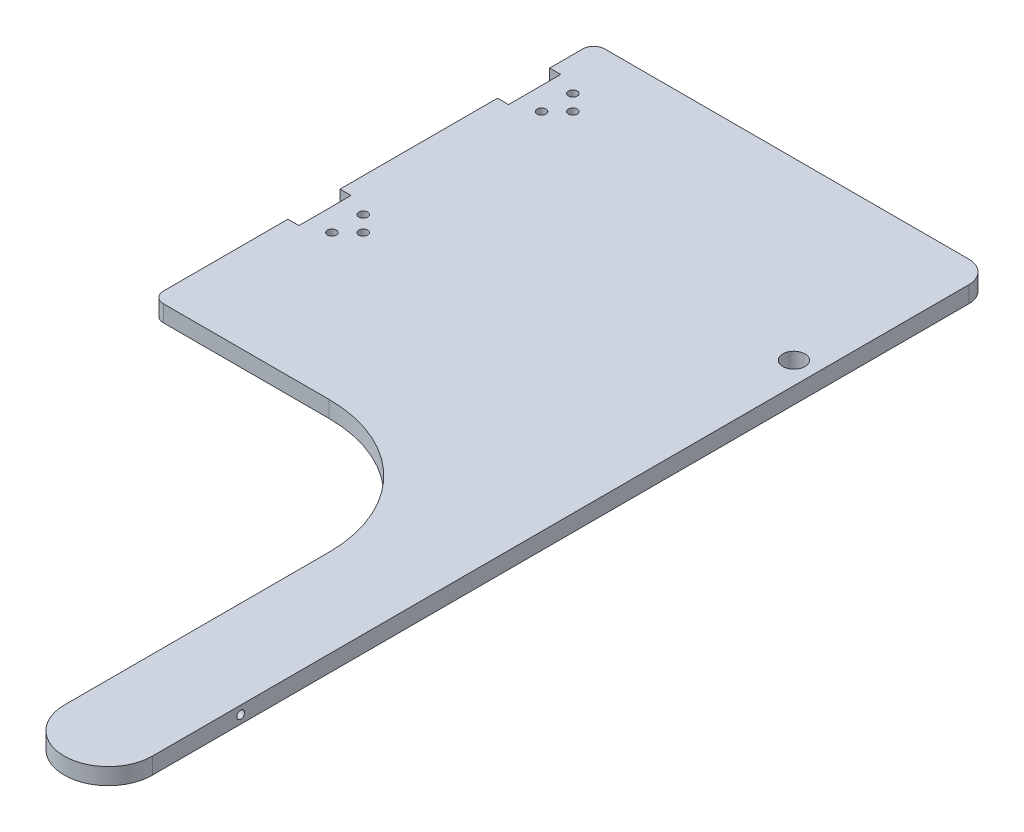
ISO-10303-21;
HEADER;
FILE_DESCRIPTION(('STEP AP214'),'2;1');
FILE_NAME('part.step','',(''),(''),'','','');
FILE_SCHEMA(('AUTOMOTIVE_DESIGN { 1 0 10303 214 1 1 1 1 }'));
ENDSEC;
DATA;
#1=APPLICATION_CONTEXT('core data for automotive mechanical design processes');
#2=APPLICATION_PROTOCOL_DEFINITION('international standard','automotive_design',2000,#1);
#3=PRODUCT_CONTEXT('',#1,'mechanical');
#4=PRODUCT('Part','Part','',(#3));
#5=PRODUCT_RELATED_PRODUCT_CATEGORY('part','',(#4));
#6=PRODUCT_DEFINITION_FORMATION('','',#4);
#7=PRODUCT_DEFINITION_CONTEXT('part definition',#1,'design');
#8=PRODUCT_DEFINITION('design','',#6,#7);
#9=PRODUCT_DEFINITION_SHAPE('','',#8);
#10=(LENGTH_UNIT() NAMED_UNIT(*) SI_UNIT(.MILLI.,.METRE.));
#11=(NAMED_UNIT(*) PLANE_ANGLE_UNIT() SI_UNIT($,.RADIAN.));
#12=(NAMED_UNIT(*) SI_UNIT($,.STERADIAN.) SOLID_ANGLE_UNIT());
#13=UNCERTAINTY_MEASURE_WITH_UNIT(LENGTH_MEASURE(1.E-05),#10,'distance_accuracy_value','');
#14=(GEOMETRIC_REPRESENTATION_CONTEXT(3) GLOBAL_UNCERTAINTY_ASSIGNED_CONTEXT((#13)) GLOBAL_UNIT_ASSIGNED_CONTEXT((#10,
#11,#12)) REPRESENTATION_CONTEXT('',''));
#15=CARTESIAN_POINT('',(0.,0.,0.));
#16=DIRECTION('',(0.,0.,1.));
#17=DIRECTION('',(1.,0.,0.));
#18=AXIS2_PLACEMENT_3D('',#15,#16,#17);
#19=CARTESIAN_POINT('',(0.,9.525,-6.35000000000004));
#20=DIRECTION('',(1.,0.,0.));
#21=DIRECTION('',(0.,0.,-1.));
#22=AXIS2_PLACEMENT_3D('',#19,#20,#21);
#23=PLANE('',#22);
#24=DIRECTION('',(0.,0.,1.));
#25=VECTOR('',#24,1.);
#26=CARTESIAN_POINT('',(0.,0.,-6.35000000000004));
#27=LINE('',#26,#25);
#28=CARTESIAN_POINT('',(0.,0.,-198.6));
#29=VERTEX_POINT('',#28);
#30=CARTESIAN_POINT('',(1.26374167059427E-12,0.,-107.95));
#31=VERTEX_POINT('',#30);
#32=EDGE_CURVE('E331',#29,#31,#27,.T.);
#33=ORIENTED_EDGE('',*,*,#32,.T.);
#34=DIRECTION('',(0.,1.,0.));
#35=VECTOR('',#34,1.);
#36=CARTESIAN_POINT('',(1.26374167059427E-12,-0.000999999999999265,-107.95));
#37=LINE('',#36,#35);
#38=CARTESIAN_POINT('',(1.26374167059427E-12,9.525,-107.95));
#39=VERTEX_POINT('',#38);
#40=EDGE_CURVE('E253',#31,#39,#37,.T.);
#41=ORIENTED_EDGE('',*,*,#40,.T.);
#42=DIRECTION('',(0.,0.,1.));
#43=VECTOR('',#42,1.);
#44=CARTESIAN_POINT('',(0.,9.525,-6.35000000000004));
#45=LINE('',#44,#43);
#46=CARTESIAN_POINT('',(0.,9.525,-198.6));
#47=VERTEX_POINT('',#46);
#48=EDGE_CURVE('E307',#47,#39,#45,.T.);
#49=ORIENTED_EDGE('',*,*,#48,.F.);
#50=DIRECTION('',(0.,1.,0.));
#51=VECTOR('',#50,1.);
#52=CARTESIAN_POINT('',(0.,-0.000999999999999265,-198.6));
#53=LINE('',#52,#51);
#54=EDGE_CURVE('E274',#29,#47,#53,.T.);
#55=ORIENTED_EDGE('',*,*,#54,.F.);
#56=EDGE_LOOP('',(#33,#41,#49,#55));
#57=FACE_BOUND('',#56,.T.);
#58=ADVANCED_FACE('F45',(#57),#23,.F.);
#59=CARTESIAN_POINT('',(0.,0.,-247.65));
#60=VERTEX_POINT('',#59);
#61=CARTESIAN_POINT('',(0.,0.,-228.6));
#62=VERTEX_POINT('',#61);
#63=EDGE_CURVE('E327',#60,#62,#27,.T.);
#64=ORIENTED_EDGE('',*,*,#63,.T.);
#65=DIRECTION('',(0.,1.,0.));
#66=VECTOR('',#65,1.);
#67=CARTESIAN_POINT('',(0.,-0.000999999999999265,-228.6));
#68=LINE('',#67,#66);
#69=CARTESIAN_POINT('',(0.,9.525,-228.6));
#70=VERTEX_POINT('',#69);
#71=EDGE_CURVE('E275',#62,#70,#68,.T.);
#72=ORIENTED_EDGE('',*,*,#71,.T.);
#73=CARTESIAN_POINT('',(0.,9.525,-247.65));
#74=VERTEX_POINT('',#73);
#75=EDGE_CURVE('E303',#74,#70,#45,.T.);
#76=ORIENTED_EDGE('',*,*,#75,.F.);
#77=DIRECTION('',(0.,-1.,0.));
#78=VECTOR('',#77,1.);
#79=CARTESIAN_POINT('',(0.,9.525,-247.65));
#80=LINE('',#79,#78);
#81=EDGE_CURVE('E342',#74,#60,#80,.T.);
#82=ORIENTED_EDGE('',*,*,#81,.T.);
#83=EDGE_LOOP('',(#64,#72,#76,#82));
#84=FACE_BOUND('',#83,.T.);
#85=ADVANCED_FACE('F433',(#84),#23,.F.);
#86=CARTESIAN_POINT('',(101.6,9.525,76.2));
#87=DIRECTION('',(0.,-1.,0.));
#88=DIRECTION('',(0.,0.,-1.));
#89=AXIS2_PLACEMENT_3D('',#86,#87,#88);
#90=CYLINDRICAL_SURFACE('',#89,76.2);
#91=CARTESIAN_POINT('',(101.6,0.,76.2));
#92=DIRECTION('',(0.,-1.,0.));
#93=DIRECTION('',(0.,0.,1.));
#94=AXIS2_PLACEMENT_3D('',#91,#92,#93);
#95=CIRCLE('',#94,76.2);
#96=CARTESIAN_POINT('',(101.6,0.,0.));
#97=VERTEX_POINT('',#96);
#98=CARTESIAN_POINT('',(177.8,0.,76.2));
#99=VERTEX_POINT('',#98);
#100=EDGE_CURVE('E285',#97,#99,#95,.T.);
#101=ORIENTED_EDGE('',*,*,#100,.T.);
#102=DIRECTION('',(0.,-1.,0.));
#103=VECTOR('',#102,1.);
#104=CARTESIAN_POINT('',(177.8,9.525,76.2));
#105=LINE('',#104,#103);
#106=CARTESIAN_POINT('',(177.8,9.525,76.2));
#107=VERTEX_POINT('',#106);
#108=EDGE_CURVE('E13',#107,#99,#105,.T.);
#109=ORIENTED_EDGE('',*,*,#108,.F.);
#110=CARTESIAN_POINT('',(101.6,9.525,76.2));
#111=DIRECTION('',(0.,-1.,0.));
#112=DIRECTION('',(0.,0.,1.));
#113=AXIS2_PLACEMENT_3D('',#110,#111,#112);
#114=CIRCLE('',#113,76.2);
#115=CARTESIAN_POINT('',(101.6,9.525,0.));
#116=VERTEX_POINT('',#115);
#117=EDGE_CURVE('E286',#116,#107,#114,.T.);
#118=ORIENTED_EDGE('',*,*,#117,.F.);
#119=DIRECTION('',(0.,-1.,0.));
#120=VECTOR('',#119,1.);
#121=CARTESIAN_POINT('',(101.6,9.525,0.));
#122=LINE('',#121,#120);
#123=EDGE_CURVE('E311',#116,#97,#122,.T.);
#124=ORIENTED_EDGE('',*,*,#123,.T.);
#125=EDGE_LOOP('',(#101,#109,#118,#124));
#126=FACE_BOUND('',#125,.T.);
#127=ADVANCED_FACE('F47',(#126),#90,.F.);
#128=CARTESIAN_POINT('',(177.8,9.525,76.2));
#129=DIRECTION('',(1.,0.,0.));
#130=DIRECTION('',(0.,0.,-1.));
#131=AXIS2_PLACEMENT_3D('',#128,#129,#130);
#132=PLANE('',#131);
#133=CARTESIAN_POINT('',(177.8,4.7625,177.8));
#134=DIRECTION('',(1.,0.,0.));
#135=DIRECTION('',(0.,0.,-1.));
#136=AXIS2_PLACEMENT_3D('',#133,#134,#135);
#137=CIRCLE('',#136,2.2479);
#138=CARTESIAN_POINT('',(177.8,4.7625,175.5521));
#139=VERTEX_POINT('',#138);
#140=EDGE_CURVE('E200',#139,#139,#137,.F.);
#141=ORIENTED_EDGE('',*,*,#140,.F.);
#142=EDGE_LOOP('',(#141));
#143=FACE_BOUND('',#142,.T.);
#144=DIRECTION('',(0.,0.,1.));
#145=VECTOR('',#144,1.);
#146=CARTESIAN_POINT('',(177.8,0.,76.2));
#147=LINE('',#146,#145);
#148=CARTESIAN_POINT('',(177.8,0.,228.6));
#149=VERTEX_POINT('',#148);
#150=EDGE_CURVE('E314',#99,#149,#147,.T.);
#151=ORIENTED_EDGE('',*,*,#150,.T.);
#152=DIRECTION('',(0.,-1.,0.));
#153=VECTOR('',#152,1.);
#154=CARTESIAN_POINT('',(177.8,9.525,228.6));
#155=LINE('',#154,#153);
#156=CARTESIAN_POINT('',(177.8,9.525,228.6));
#157=VERTEX_POINT('',#156);
#158=EDGE_CURVE('E53',#157,#149,#155,.T.);
#159=ORIENTED_EDGE('',*,*,#158,.F.);
#160=DIRECTION('',(0.,0.,1.));
#161=VECTOR('',#160,1.);
#162=CARTESIAN_POINT('',(177.8,9.525,76.2));
#163=LINE('',#162,#161);
#164=EDGE_CURVE('E289',#107,#157,#163,.T.);
#165=ORIENTED_EDGE('',*,*,#164,.F.);
#166=ORIENTED_EDGE('',*,*,#108,.T.);
#167=EDGE_LOOP('',(#151,#159,#165,#166));
#168=FACE_BOUND('',#167,.T.);
#169=ADVANCED_FACE('F386',(#143,#168),#132,.F.);
#170=CARTESIAN_POINT('',(203.2,9.525,228.6));
#171=DIRECTION('',(0.,-1.,0.));
#172=DIRECTION('',(0.,0.,-1.));
#173=AXIS2_PLACEMENT_3D('',#170,#171,#172);
#174=CYLINDRICAL_SURFACE('',#173,25.4);
#175=CARTESIAN_POINT('',(203.2,0.,228.6));
#176=DIRECTION('',(0.,1.,0.));
#177=DIRECTION('',(0.,0.,-1.));
#178=AXIS2_PLACEMENT_3D('',#175,#176,#177);
#179=CIRCLE('',#178,25.4);
#180=CARTESIAN_POINT('',(228.6,0.,228.6));
#181=VERTEX_POINT('',#180);
#182=EDGE_CURVE('E316',#149,#181,#179,.T.);
#183=ORIENTED_EDGE('',*,*,#182,.T.);
#184=DIRECTION('',(0.,-1.,0.));
#185=VECTOR('',#184,1.);
#186=CARTESIAN_POINT('',(228.6,9.525,228.6));
#187=LINE('',#186,#185);
#188=CARTESIAN_POINT('',(228.6,9.525,228.6));
#189=VERTEX_POINT('',#188);
#190=EDGE_CURVE('E354',#189,#181,#187,.T.);
#191=ORIENTED_EDGE('',*,*,#190,.F.);
#192=CARTESIAN_POINT('',(203.2,9.525,228.6));
#193=DIRECTION('',(0.,1.,0.));
#194=DIRECTION('',(0.,0.,-1.));
#195=AXIS2_PLACEMENT_3D('',#192,#193,#194);
#196=CIRCLE('',#195,25.4);
#197=EDGE_CURVE('E292',#157,#189,#196,.T.);
#198=ORIENTED_EDGE('',*,*,#197,.F.);
#199=ORIENTED_EDGE('',*,*,#158,.T.);
#200=EDGE_LOOP('',(#183,#191,#198,#199));
#201=FACE_BOUND('',#200,.T.);
#202=ADVANCED_FACE('F361',(#201),#174,.T.);
#203=CARTESIAN_POINT('',(228.6,9.525,-241.3));
#204=DIRECTION('',(-1.,0.,0.));
#205=DIRECTION('',(0.,0.,1.));
#206=AXIS2_PLACEMENT_3D('',#203,#204,#205);
#207=PLANE('',#206);
#208=CARTESIAN_POINT('',(228.6,4.7625,177.8));
#209=DIRECTION('',(1.,0.,0.));
#210=DIRECTION('',(0.,0.,-1.));
#211=AXIS2_PLACEMENT_3D('',#208,#209,#210);
#212=CIRCLE('',#211,2.2479);
#213=CARTESIAN_POINT('',(228.6,4.7625,175.5521));
#214=VERTEX_POINT('',#213);
#215=EDGE_CURVE('E197',#214,#214,#212,.T.);
#216=ORIENTED_EDGE('',*,*,#215,.F.);
#217=EDGE_LOOP('',(#216));
#218=FACE_BOUND('',#217,.T.);
#219=DIRECTION('',(0.,0.,-1.));
#220=VECTOR('',#219,1.);
#221=CARTESIAN_POINT('',(228.6,0.,-241.3));
#222=LINE('',#221,#220);
#223=CARTESIAN_POINT('',(228.6,0.,-241.3));
#224=VERTEX_POINT('',#223);
#225=EDGE_CURVE('E318',#181,#224,#222,.T.);
#226=ORIENTED_EDGE('',*,*,#225,.T.);
#227=DIRECTION('',(0.,-1.,0.));
#228=VECTOR('',#227,1.);
#229=CARTESIAN_POINT('',(228.6,9.525,-241.3));
#230=LINE('',#229,#228);
#231=CARTESIAN_POINT('',(228.6,9.525,-241.3));
#232=VERTEX_POINT('',#231);
#233=EDGE_CURVE('E351',#232,#224,#230,.T.);
#234=ORIENTED_EDGE('',*,*,#233,.F.);
#235=DIRECTION('',(0.,0.,-1.));
#236=VECTOR('',#235,1.);
#237=CARTESIAN_POINT('',(228.6,9.525,-241.3));
#238=LINE('',#237,#236);
#239=EDGE_CURVE('E294',#189,#232,#238,.T.);
#240=ORIENTED_EDGE('',*,*,#239,.F.);
#241=ORIENTED_EDGE('',*,*,#190,.T.);
#242=EDGE_LOOP('',(#226,#234,#240,#241));
#243=FACE_BOUND('',#242,.T.);
#244=ADVANCED_FACE('F372',(#218,#243),#207,.F.);
#245=CARTESIAN_POINT('',(215.9,9.525,-241.3));
#246=DIRECTION('',(0.,-1.,0.));
#247=DIRECTION('',(0.,0.,-1.));
#248=AXIS2_PLACEMENT_3D('',#245,#246,#247);
#249=CYLINDRICAL_SURFACE('',#248,12.6999999999999);
#250=CARTESIAN_POINT('',(215.9,0.,-241.3));
#251=DIRECTION('',(0.,1.,0.));
#252=DIRECTION('',(0.,0.,1.));
#253=AXIS2_PLACEMENT_3D('',#250,#251,#252);
#254=CIRCLE('',#253,12.6999999999999);
#255=CARTESIAN_POINT('',(215.9,0.,-254.));
#256=VERTEX_POINT('',#255);
#257=EDGE_CURVE('E320',#224,#256,#254,.T.);
#258=ORIENTED_EDGE('',*,*,#257,.T.);
#259=DIRECTION('',(0.,-1.,0.));
#260=VECTOR('',#259,1.);
#261=CARTESIAN_POINT('',(215.9,9.525,-254.));
#262=LINE('',#261,#260);
#263=CARTESIAN_POINT('',(215.9,9.525,-254.));
#264=VERTEX_POINT('',#263);
#265=EDGE_CURVE('E348',#264,#256,#262,.T.);
#266=ORIENTED_EDGE('',*,*,#265,.F.);
#267=CARTESIAN_POINT('',(215.9,9.525,-241.3));
#268=DIRECTION('',(0.,1.,0.));
#269=DIRECTION('',(0.,0.,1.));
#270=AXIS2_PLACEMENT_3D('',#267,#268,#269);
#271=CIRCLE('',#270,12.6999999999999);
#272=EDGE_CURVE('E296',#232,#264,#271,.T.);
#273=ORIENTED_EDGE('',*,*,#272,.F.);
#274=ORIENTED_EDGE('',*,*,#233,.T.);
#275=EDGE_LOOP('',(#258,#266,#273,#274));
#276=FACE_BOUND('',#275,.T.);
#277=ADVANCED_FACE('F376',(#276),#249,.T.);
#278=CARTESIAN_POINT('',(6.35000000000004,9.525,-254.));
#279=DIRECTION('',(0.,0.,1.));
#280=DIRECTION('',(1.,0.,0.));
#281=AXIS2_PLACEMENT_3D('',#278,#279,#280);
#282=PLANE('',#281);
#283=DIRECTION('',(-1.,0.,0.));
#284=VECTOR('',#283,1.);
#285=CARTESIAN_POINT('',(6.35000000000004,0.,-254.));
#286=LINE('',#285,#284);
#287=CARTESIAN_POINT('',(6.35000000000004,0.,-254.));
#288=VERTEX_POINT('',#287);
#289=EDGE_CURVE('E322',#256,#288,#286,.T.);
#290=ORIENTED_EDGE('',*,*,#289,.T.);
#291=DIRECTION('',(0.,-1.,0.));
#292=VECTOR('',#291,1.);
#293=CARTESIAN_POINT('',(6.35000000000004,9.525,-254.));
#294=LINE('',#293,#292);
#295=CARTESIAN_POINT('',(6.35000000000004,9.525,-254.));
#296=VERTEX_POINT('',#295);
#297=EDGE_CURVE('E345',#296,#288,#294,.T.);
#298=ORIENTED_EDGE('',*,*,#297,.F.);
#299=DIRECTION('',(-1.,0.,0.));
#300=VECTOR('',#299,1.);
#301=CARTESIAN_POINT('',(6.35000000000004,9.525,-254.));
#302=LINE('',#301,#300);
#303=EDGE_CURVE('E298',#264,#296,#302,.T.);
#304=ORIENTED_EDGE('',*,*,#303,.F.);
#305=ORIENTED_EDGE('',*,*,#265,.T.);
#306=EDGE_LOOP('',(#290,#298,#304,#305));
#307=FACE_BOUND('',#306,.T.);
#308=ADVANCED_FACE('F447',(#307),#282,.F.);
#309=CARTESIAN_POINT('',(6.35,9.525,-247.65));
#310=DIRECTION('',(0.,-1.,0.));
#311=DIRECTION('',(0.,0.,-1.));
#312=AXIS2_PLACEMENT_3D('',#309,#310,#311);
#313=CYLINDRICAL_SURFACE('',#312,6.35);
#314=CARTESIAN_POINT('',(6.35,0.,-247.65));
#315=DIRECTION('',(0.,1.,0.));
#316=DIRECTION('',(0.,0.,-1.));
#317=AXIS2_PLACEMENT_3D('',#314,#315,#316);
#318=CIRCLE('',#317,6.35);
#319=EDGE_CURVE('E324',#288,#60,#318,.T.);
#320=ORIENTED_EDGE('',*,*,#319,.T.);
#321=ORIENTED_EDGE('',*,*,#81,.F.);
#322=CARTESIAN_POINT('',(6.35,9.525,-247.65));
#323=DIRECTION('',(0.,1.,0.));
#324=DIRECTION('',(0.,0.,-1.));
#325=AXIS2_PLACEMENT_3D('',#322,#323,#324);
#326=CIRCLE('',#325,6.35);
#327=EDGE_CURVE('E300',#296,#74,#326,.T.);
#328=ORIENTED_EDGE('',*,*,#327,.F.);
#329=ORIENTED_EDGE('',*,*,#297,.T.);
#330=EDGE_LOOP('',(#320,#321,#328,#329));
#331=FACE_BOUND('',#330,.T.);
#332=ADVANCED_FACE('F442',(#331),#313,.T.);
#333=CARTESIAN_POINT('',(1.2658603095568E-12,9.525,-77.95));
#334=VERTEX_POINT('',#333);
#335=CARTESIAN_POINT('',(0.,9.525,-6.35000000000004));
#336=VERTEX_POINT('',#335);
#337=EDGE_CURVE('E302',#334,#336,#45,.T.);
#338=ORIENTED_EDGE('',*,*,#337,.F.);
#339=DIRECTION('',(0.,1.,0.));
#340=VECTOR('',#339,1.);
#341=CARTESIAN_POINT('',(1.2658603095568E-12,-0.000999999999999265,-77.95));
#342=LINE('',#341,#340);
#343=CARTESIAN_POINT('',(0.,0.,-77.95));
#344=VERTEX_POINT('',#343);
#345=EDGE_CURVE('E252',#344,#334,#342,.T.);
#346=ORIENTED_EDGE('',*,*,#345,.F.);
#347=CARTESIAN_POINT('',(0.,0.,-6.35000000000004));
#348=VERTEX_POINT('',#347);
#349=EDGE_CURVE('E326',#344,#348,#27,.T.);
#350=ORIENTED_EDGE('',*,*,#349,.T.);
#351=DIRECTION('',(0.,-1.,0.));
#352=VECTOR('',#351,1.);
#353=CARTESIAN_POINT('',(0.,9.525,-6.35000000000004));
#354=LINE('',#353,#352);
#355=EDGE_CURVE('E339',#336,#348,#354,.T.);
#356=ORIENTED_EDGE('',*,*,#355,.F.);
#357=EDGE_LOOP('',(#338,#346,#350,#356));
#358=FACE_BOUND('',#357,.T.);
#359=ADVANCED_FACE('F402',(#358),#23,.F.);
#360=CARTESIAN_POINT('',(6.35,9.525,-6.35));
#361=DIRECTION('',(0.,-1.,0.));
#362=DIRECTION('',(0.,0.,-1.));
#363=AXIS2_PLACEMENT_3D('',#360,#361,#362);
#364=CYLINDRICAL_SURFACE('',#363,6.35);
#365=CARTESIAN_POINT('',(6.35,0.,-6.35));
#366=DIRECTION('',(0.,1.,0.));
#367=DIRECTION('',(0.,0.,1.));
#368=AXIS2_PLACEMENT_3D('',#365,#366,#367);
#369=CIRCLE('',#368,6.35);
#370=CARTESIAN_POINT('',(6.35,0.,0.));
#371=VERTEX_POINT('',#370);
#372=EDGE_CURVE('E330',#348,#371,#369,.T.);
#373=ORIENTED_EDGE('',*,*,#372,.T.);
#374=DIRECTION('',(0.,-1.,0.));
#375=VECTOR('',#374,1.);
#376=CARTESIAN_POINT('',(6.35,9.525,0.));
#377=LINE('',#376,#375);
#378=CARTESIAN_POINT('',(6.35,9.525,0.));
#379=VERTEX_POINT('',#378);
#380=EDGE_CURVE('E336',#379,#371,#377,.T.);
#381=ORIENTED_EDGE('',*,*,#380,.F.);
#382=CARTESIAN_POINT('',(6.35,9.525,-6.35));
#383=DIRECTION('',(0.,1.,0.));
#384=DIRECTION('',(0.,0.,1.));
#385=AXIS2_PLACEMENT_3D('',#382,#383,#384);
#386=CIRCLE('',#385,6.35);
#387=EDGE_CURVE('E306',#336,#379,#386,.T.);
#388=ORIENTED_EDGE('',*,*,#387,.F.);
#389=ORIENTED_EDGE('',*,*,#355,.T.);
#390=EDGE_LOOP('',(#373,#381,#388,#389));
#391=FACE_BOUND('',#390,.T.);
#392=ADVANCED_FACE('F398',(#391),#364,.T.);
#393=CARTESIAN_POINT('',(6.35000000000004,9.525,0.));
#394=DIRECTION('',(0.,0.,-1.));
#395=DIRECTION('',(-1.,0.,0.));
#396=AXIS2_PLACEMENT_3D('',#393,#394,#395);
#397=PLANE('',#396);
#398=DIRECTION('',(1.,0.,0.));
#399=VECTOR('',#398,1.);
#400=CARTESIAN_POINT('',(6.35000000000004,0.,0.));
#401=LINE('',#400,#399);
#402=EDGE_CURVE('E290',#371,#97,#401,.T.);
#403=ORIENTED_EDGE('',*,*,#402,.T.);
#404=ORIENTED_EDGE('',*,*,#123,.F.);
#405=DIRECTION('',(1.,0.,0.));
#406=VECTOR('',#405,1.);
#407=CARTESIAN_POINT('',(6.35000000000004,9.525,0.));
#408=LINE('',#407,#406);
#409=EDGE_CURVE('E309',#379,#116,#408,.T.);
#410=ORIENTED_EDGE('',*,*,#409,.F.);
#411=ORIENTED_EDGE('',*,*,#380,.T.);
#412=EDGE_LOOP('',(#403,#404,#410,#411));
#413=FACE_BOUND('',#412,.T.);
#414=ADVANCED_FACE('F393',(#413),#397,.F.);
#415=CARTESIAN_POINT('',(101.6,9.525,76.2));
#416=DIRECTION('',(0.,1.,0.));
#417=DIRECTION('',(0.,0.,1.));
#418=AXIS2_PLACEMENT_3D('',#415,#416,#417);
#419=PLANE('',#418);
#420=CARTESIAN_POINT('',(215.9,9.525,-153.275));
#421=DIRECTION('',(0.,1.,0.));
#422=DIRECTION('',(0.,0.,1.));
#423=AXIS2_PLACEMENT_3D('',#420,#421,#422);
#424=CIRCLE('',#423,6.34999999999999);
#425=CARTESIAN_POINT('',(215.9,9.525,-146.925));
#426=VERTEX_POINT('',#425);
#427=EDGE_CURVE('E671',#426,#426,#424,.T.);
#428=ORIENTED_EDGE('',*,*,#427,.F.);
#429=EDGE_LOOP('',(#428));
#430=FACE_BOUND('',#429,.T.);
#431=CARTESIAN_POINT('',(28.34999918,9.525,-213.6));
#432=DIRECTION('',(0.,1.,0.));
#433=DIRECTION('',(0.,0.,1.));
#434=AXIS2_PLACEMENT_3D('',#431,#432,#433);
#435=CIRCLE('',#434,2.54);
#436=CARTESIAN_POINT('',(28.34999918,9.525,-211.06));
#437=VERTEX_POINT('',#436);
#438=EDGE_CURVE('E221',#437,#437,#435,.T.);
#439=ORIENTED_EDGE('',*,*,#438,.F.);
#440=EDGE_LOOP('',(#439));
#441=FACE_BOUND('',#440,.T.);
#442=CARTESIAN_POINT('',(19.3499994,9.525,-222.59999978));
#443=DIRECTION('',(0.,1.,0.));
#444=DIRECTION('',(0.,0.,1.));
#445=AXIS2_PLACEMENT_3D('',#442,#443,#444);
#446=CIRCLE('',#445,2.54);
#447=CARTESIAN_POINT('',(19.3499994,9.525,-220.05999978));
#448=VERTEX_POINT('',#447);
#449=EDGE_CURVE('E228',#448,#448,#446,.T.);
#450=ORIENTED_EDGE('',*,*,#449,.F.);
#451=EDGE_LOOP('',(#450));
#452=FACE_BOUND('',#451,.T.);
#453=CARTESIAN_POINT('',(19.3499994,9.525,-204.60000022));
#454=DIRECTION('',(0.,1.,0.));
#455=DIRECTION('',(0.,0.,-1.));
#456=AXIS2_PLACEMENT_3D('',#453,#454,#455);
#457=CIRCLE('',#456,2.54);
#458=CARTESIAN_POINT('',(19.3499994,9.525,-207.14000022));
#459=VERTEX_POINT('',#458);
#460=EDGE_CURVE('E234',#459,#459,#457,.T.);
#461=ORIENTED_EDGE('',*,*,#460,.F.);
#462=EDGE_LOOP('',(#461));
#463=FACE_BOUND('',#462,.T.);
#464=DIRECTION('',(-1.,0.,0.));
#465=VECTOR('',#464,1.);
#466=CARTESIAN_POINT('',(1.26374167059427E-12,9.525,-107.95));
#467=LINE('',#466,#465);
#468=CARTESIAN_POINT('',(6.35000000000126,9.525,-107.95));
#469=VERTEX_POINT('',#468);
#470=EDGE_CURVE('E250',#469,#39,#467,.T.);
#471=ORIENTED_EDGE('',*,*,#470,.F.);
#472=DIRECTION('',(0.,0.,-1.));
#473=VECTOR('',#472,1.);
#474=CARTESIAN_POINT('',(6.35000000000126,9.525,-107.95));
#475=LINE('',#474,#473);
#476=CARTESIAN_POINT('',(6.35000000000127,9.525,-77.95));
#477=VERTEX_POINT('',#476);
#478=EDGE_CURVE('E247',#477,#469,#475,.T.);
#479=ORIENTED_EDGE('',*,*,#478,.F.);
#480=DIRECTION('',(1.,0.,0.));
#481=VECTOR('',#480,1.);
#482=CARTESIAN_POINT('',(1.2658603095568E-12,9.525,-77.95));
#483=LINE('',#482,#481);
#484=EDGE_CURVE('E244',#334,#477,#483,.T.);
#485=ORIENTED_EDGE('',*,*,#484,.F.);
#486=ORIENTED_EDGE('',*,*,#337,.T.);
#487=ORIENTED_EDGE('',*,*,#387,.T.);
#488=ORIENTED_EDGE('',*,*,#409,.T.);
#489=ORIENTED_EDGE('',*,*,#117,.T.);
#490=ORIENTED_EDGE('',*,*,#164,.T.);
#491=ORIENTED_EDGE('',*,*,#197,.T.);
#492=ORIENTED_EDGE('',*,*,#239,.T.);
#493=ORIENTED_EDGE('',*,*,#272,.T.);
#494=ORIENTED_EDGE('',*,*,#303,.T.);
#495=ORIENTED_EDGE('',*,*,#327,.T.);
#496=ORIENTED_EDGE('',*,*,#75,.T.);
#497=DIRECTION('',(-1.,0.,0.));
#498=VECTOR('',#497,1.);
#499=CARTESIAN_POINT('',(0.,9.525,-228.6));
#500=LINE('',#499,#498);
#501=CARTESIAN_POINT('',(6.35,9.525,-228.6));
#502=VERTEX_POINT('',#501);
#503=EDGE_CURVE('E272',#502,#70,#500,.T.);
#504=ORIENTED_EDGE('',*,*,#503,.F.);
#505=DIRECTION('',(0.,0.,-1.));
#506=VECTOR('',#505,1.);
#507=CARTESIAN_POINT('',(6.35,9.525,-228.6));
#508=LINE('',#507,#506);
#509=CARTESIAN_POINT('',(6.35,9.525,-198.6));
#510=VERTEX_POINT('',#509);
#511=EDGE_CURVE('E269',#510,#502,#508,.T.);
#512=ORIENTED_EDGE('',*,*,#511,.F.);
#513=DIRECTION('',(1.,0.,0.));
#514=VECTOR('',#513,1.);
#515=CARTESIAN_POINT('',(0.,9.525,-198.6));
#516=LINE('',#515,#514);
#517=EDGE_CURVE('E266',#47,#510,#516,.T.);
#518=ORIENTED_EDGE('',*,*,#517,.F.);
#519=ORIENTED_EDGE('',*,*,#48,.T.);
#520=EDGE_LOOP('',(#471,#479,#485,#486,#487,#488,#489,#490,#491,#492,#493,#494,#495,#496,#504,
#512,#518,#519));
#521=FACE_BOUND('',#520,.T.);
#522=CARTESIAN_POINT('',(28.3499991800013,9.525,-92.95));
#523=DIRECTION('',(0.,1.,0.));
#524=DIRECTION('',(0.,0.,1.));
#525=AXIS2_PLACEMENT_3D('',#522,#523,#524);
#526=CIRCLE('',#525,2.54);
#527=CARTESIAN_POINT('',(28.3499991800013,9.525,-90.41));
#528=VERTEX_POINT('',#527);
#529=EDGE_CURVE('E204',#528,#528,#526,.T.);
#530=ORIENTED_EDGE('',*,*,#529,.F.);
#531=EDGE_LOOP('',(#530));
#532=FACE_BOUND('',#531,.T.);
#533=CARTESIAN_POINT('',(19.3499994000013,9.525,-101.94999978));
#534=DIRECTION('',(0.,1.,0.));
#535=DIRECTION('',(0.,0.,1.));
#536=AXIS2_PLACEMENT_3D('',#533,#534,#535);
#537=CIRCLE('',#536,2.54);
#538=CARTESIAN_POINT('',(19.3499994000013,9.525,-99.40999978));
#539=VERTEX_POINT('',#538);
#540=EDGE_CURVE('E211',#539,#539,#537,.T.);
#541=ORIENTED_EDGE('',*,*,#540,.F.);
#542=EDGE_LOOP('',(#541));
#543=FACE_BOUND('',#542,.T.);
#544=CARTESIAN_POINT('',(19.3499994000013,9.525,-83.95000022));
#545=DIRECTION('',(0.,1.,0.));
#546=DIRECTION('',(0.,0.,-1.));
#547=AXIS2_PLACEMENT_3D('',#544,#545,#546);
#548=CIRCLE('',#547,2.54);
#549=CARTESIAN_POINT('',(19.3499994000013,9.525,-86.49000022));
#550=VERTEX_POINT('',#549);
#551=EDGE_CURVE('E203',#550,#550,#548,.T.);
#552=ORIENTED_EDGE('',*,*,#551,.F.);
#553=EDGE_LOOP('',(#552));
#554=FACE_BOUND('',#553,.T.);
#555=ADVANCED_FACE('F381',(#430,#441,#452,#463,#521,#532,#543,#554),#419,.T.);
#556=CARTESIAN_POINT('',(101.6,0.,76.2));
#557=DIRECTION('',(0.,1.,0.));
#558=DIRECTION('',(0.,0.,1.));
#559=AXIS2_PLACEMENT_3D('',#556,#557,#558);
#560=PLANE('',#559);
#561=CARTESIAN_POINT('',(215.9,0.,-153.275));
#562=DIRECTION('',(0.,1.,0.));
#563=DIRECTION('',(0.,0.,1.));
#564=AXIS2_PLACEMENT_3D('',#561,#562,#563);
#565=CIRCLE('',#564,6.34999999999999);
#566=CARTESIAN_POINT('',(215.9,0.,-146.925));
#567=VERTEX_POINT('',#566);
#568=EDGE_CURVE('E191',#567,#567,#565,.T.);
#569=ORIENTED_EDGE('',*,*,#568,.T.);
#570=EDGE_LOOP('',(#569));
#571=FACE_BOUND('',#570,.T.);
#572=CARTESIAN_POINT('',(165.1,0.,-143.75));
#573=DIRECTION('',(0.,-1.,0.));
#574=DIRECTION('',(0.,0.,-1.));
#575=AXIS2_PLACEMENT_3D('',#572,#573,#574);
#576=CIRCLE('',#575,2.55269999999999);
#577=CARTESIAN_POINT('',(165.1,0.,-146.3027));
#578=VERTEX_POINT('',#577);
#579=EDGE_CURVE('E185',#578,#578,#576,.T.);
#580=ORIENTED_EDGE('',*,*,#579,.F.);
#581=EDGE_LOOP('',(#580));
#582=FACE_BOUND('',#581,.T.);
#583=CARTESIAN_POINT('',(165.1,0.,-162.8));
#584=DIRECTION('',(0.,-1.,0.));
#585=DIRECTION('',(0.,0.,-1.));
#586=AXIS2_PLACEMENT_3D('',#583,#584,#585);
#587=CIRCLE('',#586,2.55269999999999);
#588=CARTESIAN_POINT('',(165.1,0.,-165.3527));
#589=VERTEX_POINT('',#588);
#590=EDGE_CURVE('E184',#589,#589,#587,.T.);
#591=ORIENTED_EDGE('',*,*,#590,.F.);
#592=EDGE_LOOP('',(#591));
#593=FACE_BOUND('',#592,.T.);
#594=CARTESIAN_POINT('',(28.34999918,0.,-213.6));
#595=DIRECTION('',(0.,1.,0.));
#596=DIRECTION('',(0.,0.,1.));
#597=AXIS2_PLACEMENT_3D('',#594,#595,#596);
#598=CIRCLE('',#597,2.54);
#599=CARTESIAN_POINT('',(28.34999918,0.,-211.06));
#600=VERTEX_POINT('',#599);
#601=EDGE_CURVE('E224',#600,#600,#598,.F.);
#602=ORIENTED_EDGE('',*,*,#601,.F.);
#603=EDGE_LOOP('',(#602));
#604=FACE_BOUND('',#603,.T.);
#605=CARTESIAN_POINT('',(19.3499994,0.,-222.59999978));
#606=DIRECTION('',(0.,1.,0.));
#607=DIRECTION('',(0.,0.,1.));
#608=AXIS2_PLACEMENT_3D('',#605,#606,#607);
#609=CIRCLE('',#608,2.54);
#610=CARTESIAN_POINT('',(19.3499994,0.,-220.05999978));
#611=VERTEX_POINT('',#610);
#612=EDGE_CURVE('E225',#611,#611,#609,.F.);
#613=ORIENTED_EDGE('',*,*,#612,.F.);
#614=EDGE_LOOP('',(#613));
#615=FACE_BOUND('',#614,.T.);
#616=CARTESIAN_POINT('',(19.3499994,0.,-204.60000022));
#617=DIRECTION('',(0.,1.,0.));
#618=DIRECTION('',(0.,0.,1.));
#619=AXIS2_PLACEMENT_3D('',#616,#617,#618);
#620=CIRCLE('',#619,2.54);
#621=CARTESIAN_POINT('',(19.3499994,0.,-202.06000022));
#622=VERTEX_POINT('',#621);
#623=EDGE_CURVE('E231',#622,#622,#620,.F.);
#624=ORIENTED_EDGE('',*,*,#623,.F.);
#625=EDGE_LOOP('',(#624));
#626=FACE_BOUND('',#625,.T.);
#627=CARTESIAN_POINT('',(28.3499991800013,0.,-92.95));
#628=DIRECTION('',(0.,1.,0.));
#629=DIRECTION('',(0.,0.,1.));
#630=AXIS2_PLACEMENT_3D('',#627,#628,#629);
#631=CIRCLE('',#630,2.54);
#632=CARTESIAN_POINT('',(28.3499991800013,0.,-90.41));
#633=VERTEX_POINT('',#632);
#634=EDGE_CURVE('E207',#633,#633,#631,.F.);
#635=ORIENTED_EDGE('',*,*,#634,.F.);
#636=EDGE_LOOP('',(#635));
#637=FACE_BOUND('',#636,.T.);
#638=CARTESIAN_POINT('',(19.3499994000013,0.,-101.94999978));
#639=DIRECTION('',(0.,1.,0.));
#640=DIRECTION('',(0.,0.,1.));
#641=AXIS2_PLACEMENT_3D('',#638,#639,#640);
#642=CIRCLE('',#641,2.54);
#643=CARTESIAN_POINT('',(19.3499994000013,0.,-99.40999978));
#644=VERTEX_POINT('',#643);
#645=EDGE_CURVE('E208',#644,#644,#642,.F.);
#646=ORIENTED_EDGE('',*,*,#645,.F.);
#647=EDGE_LOOP('',(#646));
#648=FACE_BOUND('',#647,.T.);
#649=CARTESIAN_POINT('',(19.3499994000013,0.,-83.95000022));
#650=DIRECTION('',(0.,1.,0.));
#651=DIRECTION('',(0.,0.,1.));
#652=AXIS2_PLACEMENT_3D('',#649,#650,#651);
#653=CIRCLE('',#652,2.54);
#654=CARTESIAN_POINT('',(19.3499994000013,0.,-81.41000022));
#655=VERTEX_POINT('',#654);
#656=EDGE_CURVE('E214',#655,#655,#653,.F.);
#657=ORIENTED_EDGE('',*,*,#656,.F.);
#658=EDGE_LOOP('',(#657));
#659=FACE_BOUND('',#658,.T.);
#660=DIRECTION('',(0.,0.,1.));
#661=VECTOR('',#660,1.);
#662=CARTESIAN_POINT('',(6.35000000000126,0.,-107.95));
#663=LINE('',#662,#661);
#664=CARTESIAN_POINT('',(6.35000000000126,0.,-107.95));
#665=VERTEX_POINT('',#664);
#666=CARTESIAN_POINT('',(6.35000000000126,0.,-77.95));
#667=VERTEX_POINT('',#666);
#668=EDGE_CURVE('E60',#665,#667,#663,.T.);
#669=ORIENTED_EDGE('',*,*,#668,.F.);
#670=DIRECTION('',(1.,0.,0.));
#671=VECTOR('',#670,1.);
#672=CARTESIAN_POINT('',(1.26374167059427E-12,0.,-107.95));
#673=LINE('',#672,#671);
#674=EDGE_CURVE('E241',#31,#665,#673,.T.);
#675=ORIENTED_EDGE('',*,*,#674,.F.);
#676=ORIENTED_EDGE('',*,*,#32,.F.);
#677=DIRECTION('',(-1.,0.,0.));
#678=VECTOR('',#677,1.);
#679=CARTESIAN_POINT('',(0.,0.,-198.6));
#680=LINE('',#679,#678);
#681=CARTESIAN_POINT('',(6.34999999999999,0.,-198.6));
#682=VERTEX_POINT('',#681);
#683=EDGE_CURVE('E278',#682,#29,#680,.T.);
#684=ORIENTED_EDGE('',*,*,#683,.F.);
#685=DIRECTION('',(0.,0.,1.));
#686=VECTOR('',#685,1.);
#687=CARTESIAN_POINT('',(6.35,0.,-228.6));
#688=LINE('',#687,#686);
#689=CARTESIAN_POINT('',(6.35,0.,-228.6));
#690=VERTEX_POINT('',#689);
#691=EDGE_CURVE('E68',#690,#682,#688,.T.);
#692=ORIENTED_EDGE('',*,*,#691,.F.);
#693=DIRECTION('',(1.,0.,0.));
#694=VECTOR('',#693,1.);
#695=CARTESIAN_POINT('',(0.,0.,-228.6));
#696=LINE('',#695,#694);
#697=EDGE_CURVE('E263',#62,#690,#696,.T.);
#698=ORIENTED_EDGE('',*,*,#697,.F.);
#699=ORIENTED_EDGE('',*,*,#63,.F.);
#700=ORIENTED_EDGE('',*,*,#319,.F.);
#701=ORIENTED_EDGE('',*,*,#289,.F.);
#702=ORIENTED_EDGE('',*,*,#257,.F.);
#703=ORIENTED_EDGE('',*,*,#225,.F.);
#704=ORIENTED_EDGE('',*,*,#182,.F.);
#705=ORIENTED_EDGE('',*,*,#150,.F.);
#706=ORIENTED_EDGE('',*,*,#100,.F.);
#707=ORIENTED_EDGE('',*,*,#402,.F.);
#708=ORIENTED_EDGE('',*,*,#372,.F.);
#709=ORIENTED_EDGE('',*,*,#349,.F.);
#710=DIRECTION('',(-1.,0.,0.));
#711=VECTOR('',#710,1.);
#712=CARTESIAN_POINT('',(1.2658603095568E-12,0.,-77.95));
#713=LINE('',#712,#711);
#714=EDGE_CURVE('E237',#667,#344,#713,.T.);
#715=ORIENTED_EDGE('',*,*,#714,.F.);
#716=EDGE_LOOP('',(#669,#675,#676,#684,#692,#698,#699,#700,#701,#702,#703,#704,#705,#706,#707,
#708,#709,#715));
#717=FACE_BOUND('',#716,.T.);
#718=ADVANCED_FACE('F366',(#571,#582,#593,#604,#615,#626,#637,#648,#659,#717),#560,.F.);
#719=CARTESIAN_POINT('',(0.,-0.000999999999999265,-228.6));
#720=DIRECTION('',(0.,0.,-1.));
#721=DIRECTION('',(-1.,0.,0.));
#722=AXIS2_PLACEMENT_3D('',#719,#720,#721);
#723=PLANE('',#722);
#724=ORIENTED_EDGE('',*,*,#697,.T.);
#725=DIRECTION('',(0.,1.,0.));
#726=VECTOR('',#725,1.);
#727=CARTESIAN_POINT('',(6.35,-0.000999999999999265,-228.6));
#728=LINE('',#727,#726);
#729=EDGE_CURVE('E279',#690,#502,#728,.T.);
#730=ORIENTED_EDGE('',*,*,#729,.T.);
#731=ORIENTED_EDGE('',*,*,#503,.T.);
#732=ORIENTED_EDGE('',*,*,#71,.F.);
#733=EDGE_LOOP('',(#724,#730,#731,#732));
#734=FACE_BOUND('',#733,.T.);
#735=ADVANCED_FACE('F510',(#734),#723,.F.);
#736=CARTESIAN_POINT('',(6.35,-0.000999999999999265,-228.6));
#737=DIRECTION('',(1.,0.,0.));
#738=DIRECTION('',(0.,0.,-1.));
#739=AXIS2_PLACEMENT_3D('',#736,#737,#738);
#740=PLANE('',#739);
#741=ORIENTED_EDGE('',*,*,#691,.T.);
#742=DIRECTION('',(0.,1.,0.));
#743=VECTOR('',#742,1.);
#744=CARTESIAN_POINT('',(6.35,-0.000999999999999265,-198.6));
#745=LINE('',#744,#743);
#746=EDGE_CURVE('E281',#682,#510,#745,.T.);
#747=ORIENTED_EDGE('',*,*,#746,.T.);
#748=ORIENTED_EDGE('',*,*,#511,.T.);
#749=ORIENTED_EDGE('',*,*,#729,.F.);
#750=EDGE_LOOP('',(#741,#747,#748,#749));
#751=FACE_BOUND('',#750,.T.);
#752=ADVANCED_FACE('F526',(#751),#740,.F.);
#753=CARTESIAN_POINT('',(0.,-0.000999999999999265,-198.6));
#754=DIRECTION('',(0.,0.,1.));
#755=DIRECTION('',(1.,0.,0.));
#756=AXIS2_PLACEMENT_3D('',#753,#754,#755);
#757=PLANE('',#756);
#758=ORIENTED_EDGE('',*,*,#683,.T.);
#759=ORIENTED_EDGE('',*,*,#54,.T.);
#760=ORIENTED_EDGE('',*,*,#517,.T.);
#761=ORIENTED_EDGE('',*,*,#746,.F.);
#762=EDGE_LOOP('',(#758,#759,#760,#761));
#763=FACE_BOUND('',#762,.T.);
#764=ADVANCED_FACE('F494',(#763),#757,.F.);
#765=CARTESIAN_POINT('',(19.3499994000013,-0.000999999999999265,-83.95000022));
#766=DIRECTION('',(0.,1.,0.));
#767=DIRECTION('',(0.,0.,1.));
#768=AXIS2_PLACEMENT_3D('',#765,#766,#767);
#769=CYLINDRICAL_SURFACE('',#768,2.54);
#770=ORIENTED_EDGE('',*,*,#551,.T.);
#771=EDGE_LOOP('',(#770));
#772=FACE_BOUND('',#771,.T.);
#773=ORIENTED_EDGE('',*,*,#656,.T.);
#774=EDGE_LOOP('',(#773));
#775=FACE_BOUND('',#774,.T.);
#776=ADVANCED_FACE('F491',(#772,#775),#769,.F.);
#777=CARTESIAN_POINT('',(19.3499994000013,-0.000999999999999265,-101.94999978));
#778=DIRECTION('',(0.,1.,0.));
#779=DIRECTION('',(0.,0.,1.));
#780=AXIS2_PLACEMENT_3D('',#777,#778,#779);
#781=CYLINDRICAL_SURFACE('',#780,2.54);
#782=ORIENTED_EDGE('',*,*,#540,.T.);
#783=EDGE_LOOP('',(#782));
#784=FACE_BOUND('',#783,.T.);
#785=ORIENTED_EDGE('',*,*,#645,.T.);
#786=EDGE_LOOP('',(#785));
#787=FACE_BOUND('',#786,.T.);
#788=ADVANCED_FACE('F487',(#784,#787),#781,.F.);
#789=CARTESIAN_POINT('',(28.3499991800013,-0.000999999999999265,-92.95));
#790=DIRECTION('',(0.,1.,0.));
#791=DIRECTION('',(0.,0.,1.));
#792=AXIS2_PLACEMENT_3D('',#789,#790,#791);
#793=CYLINDRICAL_SURFACE('',#792,2.54);
#794=ORIENTED_EDGE('',*,*,#529,.T.);
#795=EDGE_LOOP('',(#794));
#796=FACE_BOUND('',#795,.T.);
#797=ORIENTED_EDGE('',*,*,#634,.T.);
#798=EDGE_LOOP('',(#797));
#799=FACE_BOUND('',#798,.T.);
#800=ADVANCED_FACE('F430',(#796,#799),#793,.F.);
#801=CARTESIAN_POINT('',(1.26374167059427E-12,-0.000999999999999265,-107.95));
#802=DIRECTION('',(0.,0.,-1.));
#803=DIRECTION('',(-1.,0.,0.));
#804=AXIS2_PLACEMENT_3D('',#801,#802,#803);
#805=PLANE('',#804);
#806=ORIENTED_EDGE('',*,*,#674,.T.);
#807=DIRECTION('',(0.,1.,0.));
#808=VECTOR('',#807,1.);
#809=CARTESIAN_POINT('',(6.35000000000126,-0.000999999999999265,-107.95));
#810=LINE('',#809,#808);
#811=EDGE_CURVE('E256',#665,#469,#810,.T.);
#812=ORIENTED_EDGE('',*,*,#811,.T.);
#813=ORIENTED_EDGE('',*,*,#470,.T.);
#814=ORIENTED_EDGE('',*,*,#40,.F.);
#815=EDGE_LOOP('',(#806,#812,#813,#814));
#816=FACE_BOUND('',#815,.T.);
#817=ADVANCED_FACE('F414',(#816),#805,.F.);
#818=CARTESIAN_POINT('',(6.35000000000126,-0.000999999999999265,-107.95));
#819=DIRECTION('',(1.,0.,0.));
#820=DIRECTION('',(0.,0.,-1.));
#821=AXIS2_PLACEMENT_3D('',#818,#819,#820);
#822=PLANE('',#821);
#823=ORIENTED_EDGE('',*,*,#668,.T.);
#824=DIRECTION('',(0.,1.,0.));
#825=VECTOR('',#824,1.);
#826=CARTESIAN_POINT('',(6.35000000000127,-0.000999999999999265,-77.95));
#827=LINE('',#826,#825);
#828=EDGE_CURVE('E258',#667,#477,#827,.T.);
#829=ORIENTED_EDGE('',*,*,#828,.T.);
#830=ORIENTED_EDGE('',*,*,#478,.T.);
#831=ORIENTED_EDGE('',*,*,#811,.F.);
#832=EDGE_LOOP('',(#823,#829,#830,#831));
#833=FACE_BOUND('',#832,.T.);
#834=ADVANCED_FACE('F421',(#833),#822,.F.);
#835=CARTESIAN_POINT('',(1.2658603095568E-12,-0.000999999999999265,-77.95));
#836=DIRECTION('',(0.,0.,1.));
#837=DIRECTION('',(1.,0.,0.));
#838=AXIS2_PLACEMENT_3D('',#835,#836,#837);
#839=PLANE('',#838);
#840=ORIENTED_EDGE('',*,*,#714,.T.);
#841=ORIENTED_EDGE('',*,*,#345,.T.);
#842=ORIENTED_EDGE('',*,*,#484,.T.);
#843=ORIENTED_EDGE('',*,*,#828,.F.);
#844=EDGE_LOOP('',(#840,#841,#842,#843));
#845=FACE_BOUND('',#844,.T.);
#846=ADVANCED_FACE('F420',(#845),#839,.F.);
#847=CARTESIAN_POINT('',(19.3499994,-0.000999999999999265,-204.60000022));
#848=DIRECTION('',(0.,1.,0.));
#849=DIRECTION('',(0.,0.,1.));
#850=AXIS2_PLACEMENT_3D('',#847,#848,#849);
#851=CYLINDRICAL_SURFACE('',#850,2.54);
#852=ORIENTED_EDGE('',*,*,#460,.T.);
#853=EDGE_LOOP('',(#852));
#854=FACE_BOUND('',#853,.T.);
#855=ORIENTED_EDGE('',*,*,#623,.T.);
#856=EDGE_LOOP('',(#855));
#857=FACE_BOUND('',#856,.T.);
#858=ADVANCED_FACE('F428',(#854,#857),#851,.F.);
#859=CARTESIAN_POINT('',(19.3499994,-0.000999999999999265,-222.59999978));
#860=DIRECTION('',(0.,1.,0.));
#861=DIRECTION('',(0.,0.,1.));
#862=AXIS2_PLACEMENT_3D('',#859,#860,#861);
#863=CYLINDRICAL_SURFACE('',#862,2.54);
#864=ORIENTED_EDGE('',*,*,#449,.T.);
#865=EDGE_LOOP('',(#864));
#866=FACE_BOUND('',#865,.T.);
#867=ORIENTED_EDGE('',*,*,#612,.T.);
#868=EDGE_LOOP('',(#867));
#869=FACE_BOUND('',#868,.T.);
#870=ADVANCED_FACE('F480',(#866,#869),#863,.F.);
#871=CARTESIAN_POINT('',(28.34999918,-0.000999999999999265,-213.6));
#872=DIRECTION('',(0.,1.,0.));
#873=DIRECTION('',(0.,0.,1.));
#874=AXIS2_PLACEMENT_3D('',#871,#872,#873);
#875=CYLINDRICAL_SURFACE('',#874,2.54);
#876=ORIENTED_EDGE('',*,*,#438,.T.);
#877=EDGE_LOOP('',(#876));
#878=FACE_BOUND('',#877,.T.);
#879=ORIENTED_EDGE('',*,*,#601,.T.);
#880=EDGE_LOOP('',(#879));
#881=FACE_BOUND('',#880,.T.);
#882=ADVANCED_FACE('F471',(#878,#881),#875,.F.);
#883=CARTESIAN_POINT('',(-0.001000000000001,4.7625,177.8));
#884=DIRECTION('',(1.,0.,0.));
#885=DIRECTION('',(0.,0.,-1.));
#886=AXIS2_PLACEMENT_3D('',#883,#884,#885);
#887=CYLINDRICAL_SURFACE('',#886,2.2479);
#888=ORIENTED_EDGE('',*,*,#215,.T.);
#889=EDGE_LOOP('',(#888));
#890=FACE_BOUND('',#889,.T.);
#891=ORIENTED_EDGE('',*,*,#140,.T.);
#892=EDGE_LOOP('',(#891));
#893=FACE_BOUND('',#892,.T.);
#894=ADVANCED_FACE('F468',(#890,#893),#887,.F.);
#895=CARTESIAN_POINT('',(165.1,3.175,-162.8));
#896=DIRECTION('',(0.,-1.,0.));
#897=DIRECTION('',(0.,0.,-1.));
#898=AXIS2_PLACEMENT_3D('',#895,#896,#897);
#899=CONICAL_SURFACE('',#898,2.55269999999999,1.02974425867665);
#900=CARTESIAN_POINT('',(165.1,4.70881690219165,-162.8));
#901=VERTEX_POINT('',#900);
#902=VERTEX_LOOP('',#901);
#903=FACE_BOUND('',#902,.T.);
#904=CARTESIAN_POINT('',(165.1,3.175,-162.8));
#905=DIRECTION('',(0.,-1.,0.));
#906=DIRECTION('',(0.,0.,-1.));
#907=AXIS2_PLACEMENT_3D('',#904,#905,#906);
#908=CIRCLE('',#907,2.55269999999999);
#909=CARTESIAN_POINT('',(165.1,3.175,-165.3527));
#910=VERTEX_POINT('',#909);
#911=EDGE_CURVE('E188',#910,#910,#908,.T.);
#912=ORIENTED_EDGE('',*,*,#911,.T.);
#913=EDGE_LOOP('',(#912));
#914=FACE_BOUND('',#913,.T.);
#915=ADVANCED_FACE('F470',(#903,#914),#899,.F.);
#916=CARTESIAN_POINT('',(165.1,0.,-162.8));
#917=DIRECTION('',(0.,-1.,0.));
#918=DIRECTION('',(0.,0.,-1.));
#919=AXIS2_PLACEMENT_3D('',#916,#917,#918);
#920=CYLINDRICAL_SURFACE('',#919,2.55269999999999);
#921=ORIENTED_EDGE('',*,*,#911,.F.);
#922=EDGE_LOOP('',(#921));
#923=FACE_BOUND('',#922,.T.);
#924=ORIENTED_EDGE('',*,*,#590,.T.);
#925=EDGE_LOOP('',(#924));
#926=FACE_BOUND('',#925,.T.);
#927=ADVANCED_FACE('F178',(#923,#926),#920,.F.);
#928=CARTESIAN_POINT('',(165.1,3.175,-143.75));
#929=DIRECTION('',(0.,-1.,0.));
#930=DIRECTION('',(0.,0.,-1.));
#931=AXIS2_PLACEMENT_3D('',#928,#929,#930);
#932=CONICAL_SURFACE('',#931,2.55269999999999,1.02974425867665);
#933=CARTESIAN_POINT('',(165.1,4.70881690219165,-143.75));
#934=VERTEX_POINT('',#933);
#935=VERTEX_LOOP('',#934);
#936=FACE_BOUND('',#935,.T.);
#937=CARTESIAN_POINT('',(165.1,3.175,-143.75));
#938=DIRECTION('',(0.,-1.,0.));
#939=DIRECTION('',(0.,0.,-1.));
#940=AXIS2_PLACEMENT_3D('',#937,#938,#939);
#941=CIRCLE('',#940,2.55269999999999);
#942=CARTESIAN_POINT('',(165.1,3.175,-146.3027));
#943=VERTEX_POINT('',#942);
#944=EDGE_CURVE('E182',#943,#943,#941,.T.);
#945=ORIENTED_EDGE('',*,*,#944,.T.);
#946=EDGE_LOOP('',(#945));
#947=FACE_BOUND('',#946,.T.);
#948=ADVANCED_FACE('F174',(#936,#947),#932,.F.);
#949=CARTESIAN_POINT('',(165.1,0.,-143.75));
#950=DIRECTION('',(0.,-1.,0.));
#951=DIRECTION('',(0.,0.,-1.));
#952=AXIS2_PLACEMENT_3D('',#949,#950,#951);
#953=CYLINDRICAL_SURFACE('',#952,2.55269999999999);
#954=ORIENTED_EDGE('',*,*,#944,.F.);
#955=EDGE_LOOP('',(#954));
#956=FACE_BOUND('',#955,.T.);
#957=ORIENTED_EDGE('',*,*,#579,.T.);
#958=EDGE_LOOP('',(#957));
#959=FACE_BOUND('',#958,.T.);
#960=ADVANCED_FACE('F177',(#956,#959),#953,.F.);
#961=CARTESIAN_POINT('',(215.9,0.,-153.275));
#962=DIRECTION('',(0.,1.,0.));
#963=DIRECTION('',(0.,0.,1.));
#964=AXIS2_PLACEMENT_3D('',#961,#962,#963);
#965=CYLINDRICAL_SURFACE('',#964,6.34999999999999);
#966=ORIENTED_EDGE('',*,*,#568,.F.);
#967=EDGE_LOOP('',(#966));
#968=FACE_BOUND('',#967,.T.);
#969=ORIENTED_EDGE('',*,*,#427,.T.);
#970=EDGE_LOOP('',(#969));
#971=FACE_BOUND('',#970,.T.);
#972=ADVANCED_FACE('F654',(#968,#971),#965,.F.);
#973=CLOSED_SHELL('',(#58,#85,#127,#169,#202,#244,#277,#308,#332,#359,#392,#414,#555,#718,#735,
#752,#764,#776,#788,#800,#817,#834,#846,#858,#870,#882,#894,#915,#927,#948,#960,#972));
#974=MANIFOLD_SOLID_BREP('B2',#973);
#975=ADVANCED_BREP_SHAPE_REPRESENTATION('',(#18,#974),#14);
#976=SHAPE_DEFINITION_REPRESENTATION(#9,#975);
ENDSEC;
END-ISO-10303-21;
